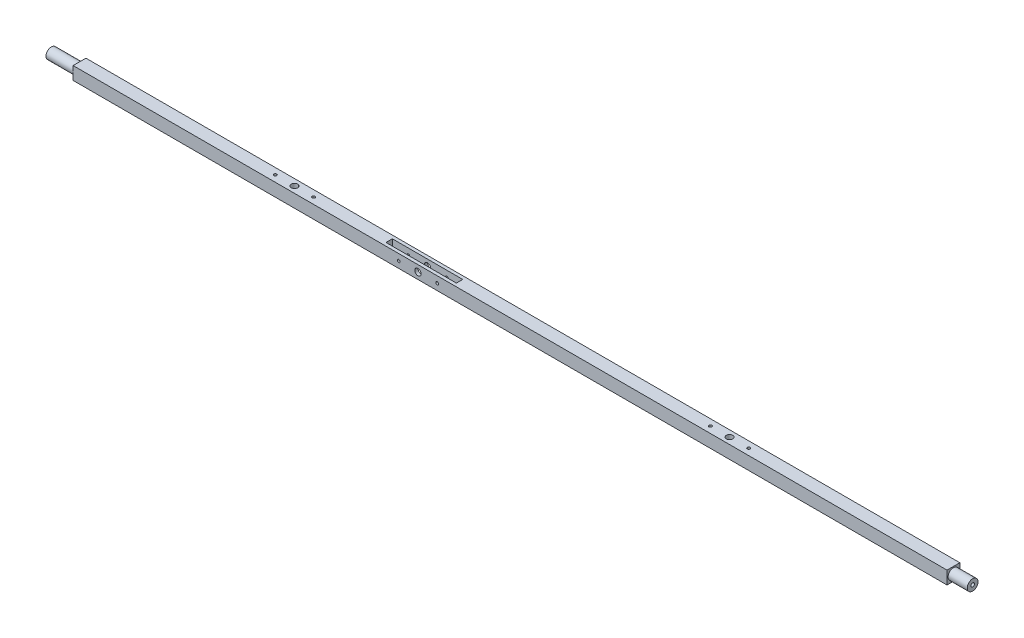
ISO-10303-21;
HEADER;
FILE_DESCRIPTION(('STEP AP214'),'2;1');
FILE_NAME('part.step','',(''),(''),'','','');
FILE_SCHEMA(('AUTOMOTIVE_DESIGN { 1 0 10303 214 1 1 1 1 }'));
ENDSEC;
DATA;
#1=APPLICATION_CONTEXT('core data for automotive mechanical design processes');
#2=APPLICATION_PROTOCOL_DEFINITION('international standard','automotive_design',2000,#1);
#3=PRODUCT_CONTEXT('',#1,'mechanical');
#4=PRODUCT('Part','Part','',(#3));
#5=PRODUCT_RELATED_PRODUCT_CATEGORY('part','',(#4));
#6=PRODUCT_DEFINITION_FORMATION('','',#4);
#7=PRODUCT_DEFINITION_CONTEXT('part definition',#1,'design');
#8=PRODUCT_DEFINITION('design','',#6,#7);
#9=PRODUCT_DEFINITION_SHAPE('','',#8);
#10=(LENGTH_UNIT() NAMED_UNIT(*) SI_UNIT(.MILLI.,.METRE.));
#11=(NAMED_UNIT(*) PLANE_ANGLE_UNIT() SI_UNIT($,.RADIAN.));
#12=(NAMED_UNIT(*) SI_UNIT($,.STERADIAN.) SOLID_ANGLE_UNIT());
#13=UNCERTAINTY_MEASURE_WITH_UNIT(LENGTH_MEASURE(1.E-05),#10,'distance_accuracy_value','');
#14=(GEOMETRIC_REPRESENTATION_CONTEXT(3) GLOBAL_UNCERTAINTY_ASSIGNED_CONTEXT((#13)) GLOBAL_UNIT_ASSIGNED_CONTEXT((#10,
#11,#12)) REPRESENTATION_CONTEXT('',''));
#15=CARTESIAN_POINT('',(0.,0.,0.));
#16=DIRECTION('',(0.,0.,1.));
#17=DIRECTION('',(1.,0.,0.));
#18=AXIS2_PLACEMENT_3D('',#15,#16,#17);
#19=CARTESIAN_POINT('',(457.2,-6.41066878980892,-6.35));
#20=DIRECTION('',(0.,0.,1.));
#21=DIRECTION('',(1.,0.,0.));
#22=AXIS2_PLACEMENT_3D('',#19,#20,#21);
#23=PLANE('',#22);
#24=CARTESIAN_POINT('',(-106.035602,0.,-6.35));
#25=DIRECTION('',(0.,0.,1.));
#26=DIRECTION('',(1.,0.,0.));
#27=AXIS2_PLACEMENT_3D('',#24,#25,#26);
#28=CIRCLE('',#27,1.39699999999999);
#29=CARTESIAN_POINT('',(-104.638602,0.,-6.35));
#30=VERTEX_POINT('',#29);
#31=EDGE_CURVE('E290',#30,#30,#28,.T.);
#32=ORIENTED_EDGE('',*,*,#31,.T.);
#33=EDGE_LOOP('',(#32));
#34=FACE_BOUND('',#33,.T.);
#35=CARTESIAN_POINT('',(-86.985602,0.,-6.35));
#36=DIRECTION('',(0.,0.,1.));
#37=DIRECTION('',(1.,0.,0.));
#38=AXIS2_PLACEMENT_3D('',#35,#36,#37);
#39=CIRCLE('',#38,3.175);
#40=CARTESIAN_POINT('',(-83.810602,0.,-6.35));
#41=VERTEX_POINT('',#40);
#42=EDGE_CURVE('E311',#41,#41,#39,.T.);
#43=ORIENTED_EDGE('',*,*,#42,.T.);
#44=EDGE_LOOP('',(#43));
#45=FACE_BOUND('',#44,.T.);
#46=CARTESIAN_POINT('',(-67.935602,0.,-6.35));
#47=DIRECTION('',(0.,0.,1.));
#48=DIRECTION('',(1.,0.,0.));
#49=AXIS2_PLACEMENT_3D('',#46,#47,#48);
#50=CIRCLE('',#49,1.39700000000001);
#51=CARTESIAN_POINT('',(-66.538602,0.,-6.35));
#52=VERTEX_POINT('',#51);
#53=EDGE_CURVE('E305',#52,#52,#50,.T.);
#54=ORIENTED_EDGE('',*,*,#53,.T.);
#55=EDGE_LOOP('',(#54));
#56=FACE_BOUND('',#55,.T.);
#57=DIRECTION('',(0.,1.,0.));
#58=VECTOR('',#57,1.);
#59=CARTESIAN_POINT('',(-429.26,0.,-6.35));
#60=LINE('',#59,#58);
#61=CARTESIAN_POINT('',(-429.26,-6.41066878980892,-6.35));
#62=VERTEX_POINT('',#61);
#63=CARTESIAN_POINT('',(-429.26,6.41066878980892,-6.35));
#64=VERTEX_POINT('',#63);
#65=EDGE_CURVE('E258',#62,#64,#60,.T.);
#66=ORIENTED_EDGE('',*,*,#65,.T.);
#67=DIRECTION('',(-1.,0.,0.));
#68=VECTOR('',#67,1.);
#69=CARTESIAN_POINT('',(457.2,6.41066878980892,-6.35));
#70=LINE('',#69,#68);
#71=CARTESIAN_POINT('',(438.15,6.41066878980892,-6.35));
#72=VERTEX_POINT('',#71);
#73=EDGE_CURVE('E12',#72,#64,#70,.T.);
#74=ORIENTED_EDGE('',*,*,#73,.F.);
#75=DIRECTION('',(0.,1.,0.));
#76=VECTOR('',#75,1.);
#77=CARTESIAN_POINT('',(438.15,0.,-6.35));
#78=LINE('',#77,#76);
#79=CARTESIAN_POINT('',(438.15,-6.41066878980892,-6.35));
#80=VERTEX_POINT('',#79);
#81=EDGE_CURVE('E269',#80,#72,#78,.T.);
#82=ORIENTED_EDGE('',*,*,#81,.F.);
#83=DIRECTION('',(-1.,0.,0.));
#84=VECTOR('',#83,1.);
#85=CARTESIAN_POINT('',(457.2,-6.41066878980892,-6.35));
#86=LINE('',#85,#84);
#87=EDGE_CURVE('E277',#80,#62,#86,.T.);
#88=ORIENTED_EDGE('',*,*,#87,.T.);
#89=EDGE_LOOP('',(#66,#74,#82,#88));
#90=FACE_BOUND('',#89,.T.);
#91=ADVANCED_FACE('F94',(#34,#45,#56,#90),#23,.F.);
#92=CARTESIAN_POINT('',(457.2,6.41066878980892,6.35));
#93=DIRECTION('',(0.,-1.,0.));
#94=DIRECTION('',(0.,0.,-1.));
#95=AXIS2_PLACEMENT_3D('',#92,#93,#94);
#96=PLANE('',#95);
#97=DIRECTION('',(1.,0.,0.));
#98=VECTOR('',#97,1.);
#99=CARTESIAN_POINT('',(-52.060602,6.41066878980892,-3.175));
#100=LINE('',#99,#98);
#101=CARTESIAN_POINT('',(-121.910602,6.41066878980892,-3.175));
#102=VERTEX_POINT('',#101);
#103=CARTESIAN_POINT('',(-52.060602,6.41066878980892,-3.175));
#104=VERTEX_POINT('',#103);
#105=EDGE_CURVE('E168',#102,#104,#100,.T.);
#106=ORIENTED_EDGE('',*,*,#105,.T.);
#107=DIRECTION('',(0.,0.,1.));
#108=VECTOR('',#107,1.);
#109=CARTESIAN_POINT('',(-52.060602,6.41066878980892,-3.175));
#110=LINE('',#109,#108);
#111=CARTESIAN_POINT('',(-52.060602,6.41066878980892,3.175));
#112=VERTEX_POINT('',#111);
#113=EDGE_CURVE('E162',#104,#112,#110,.T.);
#114=ORIENTED_EDGE('',*,*,#113,.T.);
#115=DIRECTION('',(-1.,0.,0.));
#116=VECTOR('',#115,1.);
#117=CARTESIAN_POINT('',(-52.060602,6.41066878980892,3.175));
#118=LINE('',#117,#116);
#119=CARTESIAN_POINT('',(-121.910602,6.41066878980892,3.175));
#120=VERTEX_POINT('',#119);
#121=EDGE_CURVE('E171',#112,#120,#118,.T.);
#122=ORIENTED_EDGE('',*,*,#121,.T.);
#123=DIRECTION('',(0.,0.,-1.));
#124=VECTOR('',#123,1.);
#125=CARTESIAN_POINT('',(-121.910602,6.41066878980892,-3.175));
#126=LINE('',#125,#124);
#127=EDGE_CURVE('E110',#120,#102,#126,.T.);
#128=ORIENTED_EDGE('',*,*,#127,.T.);
#129=EDGE_LOOP('',(#106,#114,#122,#128));
#130=FACE_BOUND('',#129,.T.);
#131=CARTESIAN_POINT('',(234.95,6.41066878980892,0.));
#132=DIRECTION('',(0.,1.,0.));
#133=DIRECTION('',(0.,0.,1.));
#134=AXIS2_PLACEMENT_3D('',#131,#132,#133);
#135=CIRCLE('',#134,1.42239999999999);
#136=CARTESIAN_POINT('',(234.95,6.41066878980892,1.42239999999999));
#137=VERTEX_POINT('',#136);
#138=EDGE_CURVE('E204',#137,#137,#135,.T.);
#139=ORIENTED_EDGE('',*,*,#138,.F.);
#140=EDGE_LOOP('',(#139));
#141=FACE_BOUND('',#140,.T.);
#142=CARTESIAN_POINT('',(196.85,6.41066878980892,0.));
#143=DIRECTION('',(0.,1.,0.));
#144=DIRECTION('',(0.,0.,1.));
#145=AXIS2_PLACEMENT_3D('',#142,#143,#144);
#146=CIRCLE('',#145,1.42239999999999);
#147=CARTESIAN_POINT('',(196.85,6.41066878980892,1.42239999999999));
#148=VERTEX_POINT('',#147);
#149=EDGE_CURVE('E196',#148,#148,#146,.T.);
#150=ORIENTED_EDGE('',*,*,#149,.F.);
#151=EDGE_LOOP('',(#150));
#152=FACE_BOUND('',#151,.T.);
#153=CARTESIAN_POINT('',(215.9,6.41066878980892,0.));
#154=DIRECTION('',(0.,1.,0.));
#155=DIRECTION('',(0.,0.,1.));
#156=AXIS2_PLACEMENT_3D('',#153,#154,#155);
#157=CIRCLE('',#156,3.17499999999997);
#158=CARTESIAN_POINT('',(215.9,6.41066878980892,3.17499999999997));
#159=VERTEX_POINT('',#158);
#160=EDGE_CURVE('E203',#159,#159,#157,.T.);
#161=ORIENTED_EDGE('',*,*,#160,.F.);
#162=EDGE_LOOP('',(#161));
#163=FACE_BOUND('',#162,.T.);
#164=CARTESIAN_POINT('',(-215.9,6.41066878980892,0.));
#165=DIRECTION('',(0.,1.,0.));
#166=DIRECTION('',(0.,0.,1.));
#167=AXIS2_PLACEMENT_3D('',#164,#165,#166);
#168=CIRCLE('',#167,3.17499999999997);
#169=CARTESIAN_POINT('',(-215.9,6.41066878980892,3.17499999999997));
#170=VERTEX_POINT('',#169);
#171=EDGE_CURVE('E217',#170,#170,#168,.T.);
#172=ORIENTED_EDGE('',*,*,#171,.F.);
#173=EDGE_LOOP('',(#172));
#174=FACE_BOUND('',#173,.T.);
#175=CARTESIAN_POINT('',(-196.85,6.41066878980892,0.));
#176=DIRECTION('',(0.,1.,0.));
#177=DIRECTION('',(0.,0.,1.));
#178=AXIS2_PLACEMENT_3D('',#175,#176,#177);
#179=CIRCLE('',#178,1.42239999999999);
#180=CARTESIAN_POINT('',(-196.85,6.41066878980892,1.4224));
#181=VERTEX_POINT('',#180);
#182=EDGE_CURVE('E228',#181,#181,#179,.T.);
#183=ORIENTED_EDGE('',*,*,#182,.F.);
#184=EDGE_LOOP('',(#183));
#185=FACE_BOUND('',#184,.T.);
#186=CARTESIAN_POINT('',(-234.95,6.41066878980892,0.));
#187=DIRECTION('',(0.,1.,0.));
#188=DIRECTION('',(0.,0.,1.));
#189=AXIS2_PLACEMENT_3D('',#186,#187,#188);
#190=CIRCLE('',#189,1.42239999999999);
#191=CARTESIAN_POINT('',(-234.95,6.41066878980892,1.42239999999999));
#192=VERTEX_POINT('',#191);
#193=EDGE_CURVE('E223',#192,#192,#190,.T.);
#194=ORIENTED_EDGE('',*,*,#193,.F.);
#195=EDGE_LOOP('',(#194));
#196=FACE_BOUND('',#195,.T.);
#197=DIRECTION('',(0.,0.,1.));
#198=VECTOR('',#197,1.);
#199=CARTESIAN_POINT('',(-429.26,6.41066878980892,0.));
#200=LINE('',#199,#198);
#201=CARTESIAN_POINT('',(-429.26,6.41066878980892,6.35));
#202=VERTEX_POINT('',#201);
#203=EDGE_CURVE('E255',#64,#202,#200,.T.);
#204=ORIENTED_EDGE('',*,*,#203,.T.);
#205=DIRECTION('',(-1.,0.,0.));
#206=VECTOR('',#205,1.);
#207=CARTESIAN_POINT('',(457.2,6.41066878980892,6.35));
#208=LINE('',#207,#206);
#209=CARTESIAN_POINT('',(438.15,6.41066878980892,6.35));
#210=VERTEX_POINT('',#209);
#211=EDGE_CURVE('E102',#210,#202,#208,.T.);
#212=ORIENTED_EDGE('',*,*,#211,.F.);
#213=DIRECTION('',(0.,0.,-1.));
#214=VECTOR('',#213,1.);
#215=CARTESIAN_POINT('',(438.15,6.41066878980892,0.));
#216=LINE('',#215,#214);
#217=EDGE_CURVE('E271',#210,#72,#216,.T.);
#218=ORIENTED_EDGE('',*,*,#217,.T.);
#219=ORIENTED_EDGE('',*,*,#73,.T.);
#220=EDGE_LOOP('',(#204,#212,#218,#219));
#221=FACE_BOUND('',#220,.T.);
#222=ADVANCED_FACE('F175',(#130,#141,#152,#163,#174,#185,#196,#221),#96,.F.);
#223=CARTESIAN_POINT('',(457.2,-6.41066878980892,6.35));
#224=DIRECTION('',(0.,0.,-1.));
#225=DIRECTION('',(-1.,0.,0.));
#226=AXIS2_PLACEMENT_3D('',#223,#224,#225);
#227=PLANE('',#226);
#228=CARTESIAN_POINT('',(-106.035602,0.,6.35));
#229=DIRECTION('',(0.,0.,1.));
#230=DIRECTION('',(1.,0.,0.));
#231=AXIS2_PLACEMENT_3D('',#228,#229,#230);
#232=CIRCLE('',#231,1.39699999999999);
#233=CARTESIAN_POINT('',(-104.638602,0.,6.35));
#234=VERTEX_POINT('',#233);
#235=EDGE_CURVE('E314',#234,#234,#232,.T.);
#236=ORIENTED_EDGE('',*,*,#235,.F.);
#237=EDGE_LOOP('',(#236));
#238=FACE_BOUND('',#237,.T.);
#239=CARTESIAN_POINT('',(-86.985602,0.,6.35));
#240=DIRECTION('',(0.,0.,1.));
#241=DIRECTION('',(1.,0.,0.));
#242=AXIS2_PLACEMENT_3D('',#239,#240,#241);
#243=CIRCLE('',#242,3.175);
#244=CARTESIAN_POINT('',(-83.810602,0.,6.35));
#245=VERTEX_POINT('',#244);
#246=EDGE_CURVE('E308',#245,#245,#243,.T.);
#247=ORIENTED_EDGE('',*,*,#246,.F.);
#248=EDGE_LOOP('',(#247));
#249=FACE_BOUND('',#248,.T.);
#250=CARTESIAN_POINT('',(-67.935602,0.,6.35));
#251=DIRECTION('',(0.,0.,1.));
#252=DIRECTION('',(1.,0.,0.));
#253=AXIS2_PLACEMENT_3D('',#250,#251,#252);
#254=CIRCLE('',#253,1.39700000000001);
#255=CARTESIAN_POINT('',(-66.538602,0.,6.35));
#256=VERTEX_POINT('',#255);
#257=EDGE_CURVE('E302',#256,#256,#254,.T.);
#258=ORIENTED_EDGE('',*,*,#257,.F.);
#259=EDGE_LOOP('',(#258));
#260=FACE_BOUND('',#259,.T.);
#261=DIRECTION('',(0.,1.,0.));
#262=VECTOR('',#261,1.);
#263=CARTESIAN_POINT('',(-429.26,0.,6.35));
#264=LINE('',#263,#262);
#265=CARTESIAN_POINT('',(-429.26,-6.41066878980892,6.35));
#266=VERTEX_POINT('',#265);
#267=EDGE_CURVE('E253',#266,#202,#264,.T.);
#268=ORIENTED_EDGE('',*,*,#267,.F.);
#269=DIRECTION('',(-1.,0.,0.));
#270=VECTOR('',#269,1.);
#271=CARTESIAN_POINT('',(457.2,-6.41066878980892,6.35));
#272=LINE('',#271,#270);
#273=CARTESIAN_POINT('',(438.15,-6.41066878980892,6.35));
#274=VERTEX_POINT('',#273);
#275=EDGE_CURVE('E282',#274,#266,#272,.T.);
#276=ORIENTED_EDGE('',*,*,#275,.F.);
#277=DIRECTION('',(0.,1.,0.));
#278=VECTOR('',#277,1.);
#279=CARTESIAN_POINT('',(438.15,0.,6.35));
#280=LINE('',#279,#278);
#281=EDGE_CURVE('E274',#274,#210,#280,.T.);
#282=ORIENTED_EDGE('',*,*,#281,.T.);
#283=ORIENTED_EDGE('',*,*,#211,.T.);
#284=EDGE_LOOP('',(#268,#276,#282,#283));
#285=FACE_BOUND('',#284,.T.);
#286=ADVANCED_FACE('F352',(#238,#249,#260,#285),#227,.F.);
#287=CARTESIAN_POINT('',(457.2,-6.41066878980892,6.35));
#288=DIRECTION('',(0.,1.,0.));
#289=DIRECTION('',(0.,0.,1.));
#290=AXIS2_PLACEMENT_3D('',#287,#288,#289);
#291=PLANE('',#290);
#292=DIRECTION('',(-1.,0.,0.));
#293=VECTOR('',#292,1.);
#294=CARTESIAN_POINT('',(-52.060602,-6.41066878980892,3.175));
#295=LINE('',#294,#293);
#296=CARTESIAN_POINT('',(-52.060602,-6.41066878980892,3.175));
#297=VERTEX_POINT('',#296);
#298=CARTESIAN_POINT('',(-121.910602,-6.41066878980892,3.175));
#299=VERTEX_POINT('',#298);
#300=EDGE_CURVE('E190',#297,#299,#295,.T.);
#301=ORIENTED_EDGE('',*,*,#300,.F.);
#302=DIRECTION('',(0.,0.,1.));
#303=VECTOR('',#302,1.);
#304=CARTESIAN_POINT('',(-52.060602,-6.41066878980892,-3.175));
#305=LINE('',#304,#303);
#306=CARTESIAN_POINT('',(-52.060602,-6.41066878980892,-3.175));
#307=VERTEX_POINT('',#306);
#308=EDGE_CURVE('E118',#307,#297,#305,.T.);
#309=ORIENTED_EDGE('',*,*,#308,.F.);
#310=DIRECTION('',(1.,0.,0.));
#311=VECTOR('',#310,1.);
#312=CARTESIAN_POINT('',(-52.060602,-6.41066878980892,-3.175));
#313=LINE('',#312,#311);
#314=CARTESIAN_POINT('',(-121.910602,-6.41066878980892,-3.175));
#315=VERTEX_POINT('',#314);
#316=EDGE_CURVE('E178',#315,#307,#313,.T.);
#317=ORIENTED_EDGE('',*,*,#316,.F.);
#318=DIRECTION('',(0.,0.,-1.));
#319=VECTOR('',#318,1.);
#320=CARTESIAN_POINT('',(-121.910602,-6.41066878980892,-3.175));
#321=LINE('',#320,#319);
#322=EDGE_CURVE('E181',#299,#315,#321,.T.);
#323=ORIENTED_EDGE('',*,*,#322,.F.);
#324=EDGE_LOOP('',(#301,#309,#317,#323));
#325=FACE_BOUND('',#324,.T.);
#326=CARTESIAN_POINT('',(215.9,-6.41066878980892,0.));
#327=DIRECTION('',(0.,1.,0.));
#328=DIRECTION('',(0.,0.,1.));
#329=AXIS2_PLACEMENT_3D('',#326,#327,#328);
#330=CIRCLE('',#329,3.17499999999997);
#331=CARTESIAN_POINT('',(215.9,-6.41066878980892,3.17499999999997));
#332=VERTEX_POINT('',#331);
#333=EDGE_CURVE('E214',#332,#332,#330,.F.);
#334=ORIENTED_EDGE('',*,*,#333,.F.);
#335=EDGE_LOOP('',(#334));
#336=FACE_BOUND('',#335,.T.);
#337=CARTESIAN_POINT('',(-215.9,-6.41066878980892,0.));
#338=DIRECTION('',(0.,1.,0.));
#339=DIRECTION('',(0.,0.,1.));
#340=AXIS2_PLACEMENT_3D('',#337,#338,#339);
#341=CIRCLE('',#340,3.17499999999997);
#342=CARTESIAN_POINT('',(-215.9,-6.41066878980892,3.17499999999997));
#343=VERTEX_POINT('',#342);
#344=EDGE_CURVE('E220',#343,#343,#341,.F.);
#345=ORIENTED_EDGE('',*,*,#344,.F.);
#346=EDGE_LOOP('',(#345));
#347=FACE_BOUND('',#346,.T.);
#348=DIRECTION('',(0.,0.,1.));
#349=VECTOR('',#348,1.);
#350=CARTESIAN_POINT('',(-429.26,-6.41066878980892,0.));
#351=LINE('',#350,#349);
#352=EDGE_CURVE('E251',#62,#266,#351,.T.);
#353=ORIENTED_EDGE('',*,*,#352,.F.);
#354=ORIENTED_EDGE('',*,*,#87,.F.);
#355=DIRECTION('',(0.,0.,-1.));
#356=VECTOR('',#355,1.);
#357=CARTESIAN_POINT('',(438.15,-6.41066878980892,0.));
#358=LINE('',#357,#356);
#359=EDGE_CURVE('E267',#274,#80,#358,.T.);
#360=ORIENTED_EDGE('',*,*,#359,.F.);
#361=ORIENTED_EDGE('',*,*,#275,.T.);
#362=EDGE_LOOP('',(#353,#354,#360,#361));
#363=FACE_BOUND('',#362,.T.);
#364=ADVANCED_FACE('F356',(#325,#336,#347,#363),#291,.F.);
#365=CARTESIAN_POINT('',(438.15,0.,0.));
#366=DIRECTION('',(1.,0.,0.));
#367=DIRECTION('',(0.,0.,-1.));
#368=AXIS2_PLACEMENT_3D('',#365,#366,#367);
#369=CYLINDRICAL_SURFACE('',#368,5.334);
#370=CARTESIAN_POINT('',(438.15,0.,0.));
#371=DIRECTION('',(1.,0.,0.));
#372=DIRECTION('',(0.,0.,-1.));
#373=AXIS2_PLACEMENT_3D('',#370,#371,#372);
#374=CIRCLE('',#373,5.334);
#375=CARTESIAN_POINT('',(438.15,0.,-5.334));
#376=VERTEX_POINT('',#375);
#377=EDGE_CURVE('E264',#376,#376,#374,.T.);
#378=ORIENTED_EDGE('',*,*,#377,.T.);
#379=EDGE_LOOP('',(#378));
#380=FACE_BOUND('',#379,.T.);
#381=CARTESIAN_POINT('',(457.2,0.,0.));
#382=DIRECTION('',(1.,0.,0.));
#383=DIRECTION('',(0.,0.,-1.));
#384=AXIS2_PLACEMENT_3D('',#381,#382,#383);
#385=CIRCLE('',#384,5.334);
#386=CARTESIAN_POINT('',(457.2,0.,-5.334));
#387=VERTEX_POINT('',#386);
#388=EDGE_CURVE('E261',#387,#387,#385,.T.);
#389=ORIENTED_EDGE('',*,*,#388,.F.);
#390=EDGE_LOOP('',(#389));
#391=FACE_BOUND('',#390,.T.);
#392=ADVANCED_FACE('F362',(#380,#391),#369,.T.);
#393=CARTESIAN_POINT('',(438.15,0.,0.));
#394=DIRECTION('',(1.,0.,0.));
#395=DIRECTION('',(0.,0.,-1.));
#396=AXIS2_PLACEMENT_3D('',#393,#394,#395);
#397=PLANE('',#396);
#398=ORIENTED_EDGE('',*,*,#377,.F.);
#399=EDGE_LOOP('',(#398));
#400=FACE_BOUND('',#399,.T.);
#401=ORIENTED_EDGE('',*,*,#359,.T.);
#402=ORIENTED_EDGE('',*,*,#81,.T.);
#403=ORIENTED_EDGE('',*,*,#217,.F.);
#404=ORIENTED_EDGE('',*,*,#281,.F.);
#405=EDGE_LOOP('',(#401,#402,#403,#404));
#406=FACE_BOUND('',#405,.T.);
#407=ADVANCED_FACE('F374',(#400,#406),#397,.T.);
#408=CARTESIAN_POINT('',(457.2,0.,0.));
#409=DIRECTION('',(-1.,0.,0.));
#410=DIRECTION('',(0.,0.,1.));
#411=AXIS2_PLACEMENT_3D('',#408,#409,#410);
#412=PLANE('',#411);
#413=CARTESIAN_POINT('',(457.2,0.,0.));
#414=DIRECTION('',(1.,0.,0.));
#415=DIRECTION('',(0.,0.,-1.));
#416=AXIS2_PLACEMENT_3D('',#413,#414,#415);
#417=CIRCLE('',#416,1.7526);
#418=CARTESIAN_POINT('',(457.2,0.,-1.7526));
#419=VERTEX_POINT('',#418);
#420=EDGE_CURVE('E239',#419,#419,#417,.T.);
#421=ORIENTED_EDGE('',*,*,#420,.F.);
#422=EDGE_LOOP('',(#421));
#423=FACE_BOUND('',#422,.T.);
#424=ORIENTED_EDGE('',*,*,#388,.T.);
#425=EDGE_LOOP('',(#424));
#426=FACE_BOUND('',#425,.T.);
#427=ADVANCED_FACE('F370',(#423,#426),#412,.F.);
#428=CARTESIAN_POINT('',(-429.26,0.,0.));
#429=DIRECTION('',(-1.,0.,0.));
#430=DIRECTION('',(0.,0.,1.));
#431=AXIS2_PLACEMENT_3D('',#428,#429,#430);
#432=CYLINDRICAL_SURFACE('',#431,5.334);
#433=CARTESIAN_POINT('',(-429.26,0.,0.));
#434=DIRECTION('',(-1.,0.,0.));
#435=DIRECTION('',(0.,0.,1.));
#436=AXIS2_PLACEMENT_3D('',#433,#434,#435);
#437=CIRCLE('',#436,5.334);
#438=CARTESIAN_POINT('',(-429.26,0.,5.334));
#439=VERTEX_POINT('',#438);
#440=EDGE_CURVE('E248',#439,#439,#437,.T.);
#441=ORIENTED_EDGE('',*,*,#440,.T.);
#442=EDGE_LOOP('',(#441));
#443=FACE_BOUND('',#442,.T.);
#444=CARTESIAN_POINT('',(-457.2,0.,0.));
#445=DIRECTION('',(-1.,0.,0.));
#446=DIRECTION('',(0.,0.,1.));
#447=AXIS2_PLACEMENT_3D('',#444,#445,#446);
#448=CIRCLE('',#447,5.334);
#449=CARTESIAN_POINT('',(-457.2,0.,5.334));
#450=VERTEX_POINT('',#449);
#451=EDGE_CURVE('E245',#450,#450,#448,.T.);
#452=ORIENTED_EDGE('',*,*,#451,.F.);
#453=EDGE_LOOP('',(#452));
#454=FACE_BOUND('',#453,.T.);
#455=ADVANCED_FACE('F373',(#443,#454),#432,.T.);
#456=CARTESIAN_POINT('',(-429.26,0.,0.));
#457=DIRECTION('',(-1.,0.,0.));
#458=DIRECTION('',(0.,0.,1.));
#459=AXIS2_PLACEMENT_3D('',#456,#457,#458);
#460=PLANE('',#459);
#461=ORIENTED_EDGE('',*,*,#440,.F.);
#462=EDGE_LOOP('',(#461));
#463=FACE_BOUND('',#462,.T.);
#464=ORIENTED_EDGE('',*,*,#352,.T.);
#465=ORIENTED_EDGE('',*,*,#267,.T.);
#466=ORIENTED_EDGE('',*,*,#203,.F.);
#467=ORIENTED_EDGE('',*,*,#65,.F.);
#468=EDGE_LOOP('',(#464,#465,#466,#467));
#469=FACE_BOUND('',#468,.T.);
#470=ADVANCED_FACE('F368',(#463,#469),#460,.T.);
#471=CARTESIAN_POINT('',(-457.2,0.,0.));
#472=DIRECTION('',(-1.,0.,0.));
#473=DIRECTION('',(0.,0.,1.));
#474=AXIS2_PLACEMENT_3D('',#471,#472,#473);
#475=PLANE('',#474);
#476=CARTESIAN_POINT('',(-457.2,0.,0.));
#477=DIRECTION('',(-1.,0.,0.));
#478=DIRECTION('',(0.,0.,1.));
#479=AXIS2_PLACEMENT_3D('',#476,#477,#478);
#480=CIRCLE('',#479,1.7526);
#481=CARTESIAN_POINT('',(-457.2,0.,1.7526));
#482=VERTEX_POINT('',#481);
#483=EDGE_CURVE('E227',#482,#482,#480,.T.);
#484=ORIENTED_EDGE('',*,*,#483,.F.);
#485=EDGE_LOOP('',(#484));
#486=FACE_BOUND('',#485,.T.);
#487=ORIENTED_EDGE('',*,*,#451,.T.);
#488=EDGE_LOOP('',(#487));
#489=FACE_BOUND('',#488,.T.);
#490=ADVANCED_FACE('F364',(#486,#489),#475,.T.);
#491=CARTESIAN_POINT('',(444.5,0.,0.));
#492=DIRECTION('',(1.,0.,0.));
#493=DIRECTION('',(0.,0.,-1.));
#494=AXIS2_PLACEMENT_3D('',#491,#492,#493);
#495=CYLINDRICAL_SURFACE('',#494,1.7526);
#496=CARTESIAN_POINT('',(444.5,0.,0.));
#497=DIRECTION('',(1.,0.,0.));
#498=DIRECTION('',(0.,0.,-1.));
#499=AXIS2_PLACEMENT_3D('',#496,#497,#498);
#500=CIRCLE('',#499,1.7526);
#501=CARTESIAN_POINT('',(444.5,0.,-1.7526));
#502=VERTEX_POINT('',#501);
#503=EDGE_CURVE('E242',#502,#502,#500,.T.);
#504=ORIENTED_EDGE('',*,*,#503,.F.);
#505=EDGE_LOOP('',(#504));
#506=FACE_BOUND('',#505,.T.);
#507=ORIENTED_EDGE('',*,*,#420,.T.);
#508=EDGE_LOOP('',(#507));
#509=FACE_BOUND('',#508,.T.);
#510=ADVANCED_FACE('F367',(#506,#509),#495,.F.);
#511=CARTESIAN_POINT('',(444.5,0.,0.));
#512=DIRECTION('',(1.,0.,0.));
#513=DIRECTION('',(0.,0.,-1.));
#514=AXIS2_PLACEMENT_3D('',#511,#512,#513);
#515=PLANE('',#514);
#516=ORIENTED_EDGE('',*,*,#503,.T.);
#517=EDGE_LOOP('',(#516));
#518=FACE_BOUND('',#517,.T.);
#519=ADVANCED_FACE('F390',(#518),#515,.T.);
#520=CARTESIAN_POINT('',(-438.15,0.,0.));
#521=DIRECTION('',(-1.,0.,0.));
#522=DIRECTION('',(0.,0.,1.));
#523=AXIS2_PLACEMENT_3D('',#520,#521,#522);
#524=CYLINDRICAL_SURFACE('',#523,1.7526);
#525=CARTESIAN_POINT('',(-438.15,0.,0.));
#526=DIRECTION('',(-1.,0.,0.));
#527=DIRECTION('',(0.,0.,1.));
#528=AXIS2_PLACEMENT_3D('',#525,#526,#527);
#529=CIRCLE('',#528,1.7526);
#530=CARTESIAN_POINT('',(-438.15,0.,1.7526));
#531=VERTEX_POINT('',#530);
#532=EDGE_CURVE('E236',#531,#531,#529,.T.);
#533=ORIENTED_EDGE('',*,*,#532,.F.);
#534=EDGE_LOOP('',(#533));
#535=FACE_BOUND('',#534,.T.);
#536=ORIENTED_EDGE('',*,*,#483,.T.);
#537=EDGE_LOOP('',(#536));
#538=FACE_BOUND('',#537,.T.);
#539=ADVANCED_FACE('F394',(#535,#538),#524,.F.);
#540=CARTESIAN_POINT('',(-438.15,0.,0.));
#541=DIRECTION('',(-1.,0.,0.));
#542=DIRECTION('',(0.,0.,1.));
#543=AXIS2_PLACEMENT_3D('',#540,#541,#542);
#544=PLANE('',#543);
#545=ORIENTED_EDGE('',*,*,#532,.T.);
#546=EDGE_LOOP('',(#545));
#547=FACE_BOUND('',#546,.T.);
#548=ADVANCED_FACE('F398',(#547),#544,.T.);
#549=CARTESIAN_POINT('',(-234.95,-4.51133121019108,0.));
#550=DIRECTION('',(0.,1.,0.));
#551=DIRECTION('',(0.,0.,1.));
#552=AXIS2_PLACEMENT_3D('',#549,#550,#551);
#553=CYLINDRICAL_SURFACE('',#552,1.42239999999999);
#554=CARTESIAN_POINT('',(-234.95,-4.51133121019108,0.));
#555=DIRECTION('',(0.,1.,0.));
#556=DIRECTION('',(0.,0.,1.));
#557=AXIS2_PLACEMENT_3D('',#554,#555,#556);
#558=CIRCLE('',#557,1.42239999999999);
#559=CARTESIAN_POINT('',(-234.95,-4.51133121019108,1.42239999999999));
#560=VERTEX_POINT('',#559);
#561=EDGE_CURVE('E231',#560,#560,#558,.T.);
#562=ORIENTED_EDGE('',*,*,#561,.F.);
#563=EDGE_LOOP('',(#562));
#564=FACE_BOUND('',#563,.T.);
#565=ORIENTED_EDGE('',*,*,#193,.T.);
#566=EDGE_LOOP('',(#565));
#567=FACE_BOUND('',#566,.T.);
#568=ADVANCED_FACE('F402',(#564,#567),#553,.F.);
#569=CARTESIAN_POINT('',(0.,-4.51133121019108,0.));
#570=DIRECTION('',(0.,1.,0.));
#571=DIRECTION('',(0.,0.,1.));
#572=AXIS2_PLACEMENT_3D('',#569,#570,#571);
#573=PLANE('',#572);
#574=ORIENTED_EDGE('',*,*,#561,.T.);
#575=EDGE_LOOP('',(#574));
#576=FACE_BOUND('',#575,.T.);
#577=ADVANCED_FACE('F406',(#576),#573,.T.);
#578=CARTESIAN_POINT('',(-196.85,-4.51133121019108,0.));
#579=DIRECTION('',(0.,1.,0.));
#580=DIRECTION('',(0.,0.,1.));
#581=AXIS2_PLACEMENT_3D('',#578,#579,#580);
#582=CYLINDRICAL_SURFACE('',#581,1.42239999999999);
#583=CARTESIAN_POINT('',(-196.85,-4.51133121019108,0.));
#584=DIRECTION('',(0.,1.,0.));
#585=DIRECTION('',(0.,0.,1.));
#586=AXIS2_PLACEMENT_3D('',#583,#584,#585);
#587=CIRCLE('',#586,1.42239999999999);
#588=CARTESIAN_POINT('',(-196.85,-4.51133121019108,1.4224));
#589=VERTEX_POINT('',#588);
#590=EDGE_CURVE('E224',#589,#589,#587,.T.);
#591=ORIENTED_EDGE('',*,*,#590,.F.);
#592=EDGE_LOOP('',(#591));
#593=FACE_BOUND('',#592,.T.);
#594=ORIENTED_EDGE('',*,*,#182,.T.);
#595=EDGE_LOOP('',(#594));
#596=FACE_BOUND('',#595,.T.);
#597=ADVANCED_FACE('F410',(#593,#596),#582,.F.);
#598=CARTESIAN_POINT('',(0.,-4.51133121019108,0.));
#599=DIRECTION('',(0.,1.,0.));
#600=DIRECTION('',(0.,0.,1.));
#601=AXIS2_PLACEMENT_3D('',#598,#599,#600);
#602=PLANE('',#601);
#603=ORIENTED_EDGE('',*,*,#590,.T.);
#604=EDGE_LOOP('',(#603));
#605=FACE_BOUND('',#604,.T.);
#606=ADVANCED_FACE('F414',(#605),#602,.T.);
#607=CARTESIAN_POINT('',(-215.9,-6.41166878980892,0.));
#608=DIRECTION('',(0.,1.,0.));
#609=DIRECTION('',(0.,0.,1.));
#610=AXIS2_PLACEMENT_3D('',#607,#608,#609);
#611=CYLINDRICAL_SURFACE('',#610,3.17499999999997);
#612=ORIENTED_EDGE('',*,*,#171,.T.);
#613=EDGE_LOOP('',(#612));
#614=FACE_BOUND('',#613,.T.);
#615=ORIENTED_EDGE('',*,*,#344,.T.);
#616=EDGE_LOOP('',(#615));
#617=FACE_BOUND('',#616,.T.);
#618=ADVANCED_FACE('F418',(#614,#617),#611,.F.);
#619=CARTESIAN_POINT('',(215.9,-6.41166878980892,0.));
#620=DIRECTION('',(0.,1.,0.));
#621=DIRECTION('',(0.,0.,1.));
#622=AXIS2_PLACEMENT_3D('',#619,#620,#621);
#623=CYLINDRICAL_SURFACE('',#622,3.17499999999997);
#624=ORIENTED_EDGE('',*,*,#160,.T.);
#625=EDGE_LOOP('',(#624));
#626=FACE_BOUND('',#625,.T.);
#627=ORIENTED_EDGE('',*,*,#333,.T.);
#628=EDGE_LOOP('',(#627));
#629=FACE_BOUND('',#628,.T.);
#630=ADVANCED_FACE('F422',(#626,#629),#623,.F.);
#631=CARTESIAN_POINT('',(196.85,-4.51133121019108,0.));
#632=DIRECTION('',(0.,1.,0.));
#633=DIRECTION('',(0.,0.,1.));
#634=AXIS2_PLACEMENT_3D('',#631,#632,#633);
#635=CYLINDRICAL_SURFACE('',#634,1.42239999999999);
#636=CARTESIAN_POINT('',(196.85,-4.51133121019108,0.));
#637=DIRECTION('',(0.,1.,0.));
#638=DIRECTION('',(0.,0.,1.));
#639=AXIS2_PLACEMENT_3D('',#636,#637,#638);
#640=CIRCLE('',#639,1.42239999999999);
#641=CARTESIAN_POINT('',(196.85,-4.51133121019108,1.42239999999999));
#642=VERTEX_POINT('',#641);
#643=EDGE_CURVE('E207',#642,#642,#640,.T.);
#644=ORIENTED_EDGE('',*,*,#643,.F.);
#645=EDGE_LOOP('',(#644));
#646=FACE_BOUND('',#645,.T.);
#647=ORIENTED_EDGE('',*,*,#149,.T.);
#648=EDGE_LOOP('',(#647));
#649=FACE_BOUND('',#648,.T.);
#650=ADVANCED_FACE('F426',(#646,#649),#635,.F.);
#651=CARTESIAN_POINT('',(196.85,-4.51133121019108,0.));
#652=DIRECTION('',(0.,1.,0.));
#653=DIRECTION('',(0.,0.,1.));
#654=AXIS2_PLACEMENT_3D('',#651,#652,#653);
#655=PLANE('',#654);
#656=ORIENTED_EDGE('',*,*,#643,.T.);
#657=EDGE_LOOP('',(#656));
#658=FACE_BOUND('',#657,.T.);
#659=ADVANCED_FACE('F430',(#658),#655,.T.);
#660=CARTESIAN_POINT('',(234.95,-4.51133121019108,0.));
#661=DIRECTION('',(0.,1.,0.));
#662=DIRECTION('',(0.,0.,1.));
#663=AXIS2_PLACEMENT_3D('',#660,#661,#662);
#664=CYLINDRICAL_SURFACE('',#663,1.42239999999999);
#665=CARTESIAN_POINT('',(234.95,-4.51133121019108,0.));
#666=DIRECTION('',(0.,1.,0.));
#667=DIRECTION('',(0.,0.,1.));
#668=AXIS2_PLACEMENT_3D('',#665,#666,#667);
#669=CIRCLE('',#668,1.42239999999999);
#670=CARTESIAN_POINT('',(234.95,-4.51133121019108,1.42239999999999));
#671=VERTEX_POINT('',#670);
#672=EDGE_CURVE('E200',#671,#671,#669,.T.);
#673=ORIENTED_EDGE('',*,*,#672,.F.);
#674=EDGE_LOOP('',(#673));
#675=FACE_BOUND('',#674,.T.);
#676=ORIENTED_EDGE('',*,*,#138,.T.);
#677=EDGE_LOOP('',(#676));
#678=FACE_BOUND('',#677,.T.);
#679=ADVANCED_FACE('F434',(#675,#678),#664,.F.);
#680=CARTESIAN_POINT('',(234.95,-4.51133121019108,0.));
#681=DIRECTION('',(0.,1.,0.));
#682=DIRECTION('',(0.,0.,1.));
#683=AXIS2_PLACEMENT_3D('',#680,#681,#682);
#684=PLANE('',#683);
#685=ORIENTED_EDGE('',*,*,#672,.T.);
#686=EDGE_LOOP('',(#685));
#687=FACE_BOUND('',#686,.T.);
#688=ADVANCED_FACE('F438',(#687),#684,.T.);
#689=CARTESIAN_POINT('',(-52.060602,6.41066878980892,-3.175));
#690=DIRECTION('',(1.,0.,0.));
#691=DIRECTION('',(0.,0.,-1.));
#692=AXIS2_PLACEMENT_3D('',#689,#690,#691);
#693=PLANE('',#692);
#694=ORIENTED_EDGE('',*,*,#308,.T.);
#695=DIRECTION('',(0.,-1.,0.));
#696=VECTOR('',#695,1.);
#697=CARTESIAN_POINT('',(-52.060602,6.41066878980892,3.175));
#698=LINE('',#697,#696);
#699=EDGE_CURVE('E158',#112,#297,#698,.T.);
#700=ORIENTED_EDGE('',*,*,#699,.F.);
#701=ORIENTED_EDGE('',*,*,#113,.F.);
#702=DIRECTION('',(0.,-1.,0.));
#703=VECTOR('',#702,1.);
#704=CARTESIAN_POINT('',(-52.060602,6.41066878980892,-3.175));
#705=LINE('',#704,#703);
#706=EDGE_CURVE('E194',#104,#307,#705,.T.);
#707=ORIENTED_EDGE('',*,*,#706,.T.);
#708=EDGE_LOOP('',(#694,#700,#701,#707));
#709=FACE_BOUND('',#708,.T.);
#710=ADVANCED_FACE('F160',(#709),#693,.F.);
#711=CARTESIAN_POINT('',(-52.060602,6.41066878980892,-3.175));
#712=DIRECTION('',(0.,0.,-1.));
#713=DIRECTION('',(-1.,0.,0.));
#714=AXIS2_PLACEMENT_3D('',#711,#712,#713);
#715=PLANE('',#714);
#716=CARTESIAN_POINT('',(-106.035602,0.,-3.175));
#717=DIRECTION('',(0.,0.,-1.));
#718=DIRECTION('',(-1.,0.,0.));
#719=AXIS2_PLACEMENT_3D('',#716,#717,#718);
#720=CIRCLE('',#719,1.39699999999999);
#721=CARTESIAN_POINT('',(-107.432602,0.,-3.175));
#722=VERTEX_POINT('',#721);
#723=EDGE_CURVE('E184',#722,#722,#720,.T.);
#724=ORIENTED_EDGE('',*,*,#723,.T.);
#725=EDGE_LOOP('',(#724));
#726=FACE_BOUND('',#725,.T.);
#727=CARTESIAN_POINT('',(-86.985602,0.,-3.175));
#728=DIRECTION('',(0.,0.,-1.));
#729=DIRECTION('',(-1.,0.,0.));
#730=AXIS2_PLACEMENT_3D('',#727,#728,#729);
#731=CIRCLE('',#730,3.175);
#732=CARTESIAN_POINT('',(-90.160602,0.,-3.175));
#733=VERTEX_POINT('',#732);
#734=EDGE_CURVE('E293',#733,#733,#731,.T.);
#735=ORIENTED_EDGE('',*,*,#734,.T.);
#736=EDGE_LOOP('',(#735));
#737=FACE_BOUND('',#736,.T.);
#738=CARTESIAN_POINT('',(-67.935602,0.,-3.175));
#739=DIRECTION('',(0.,0.,-1.));
#740=DIRECTION('',(-1.,0.,0.));
#741=AXIS2_PLACEMENT_3D('',#738,#739,#740);
#742=CIRCLE('',#741,1.39700000000001);
#743=CARTESIAN_POINT('',(-69.3326020000001,0.,-3.175));
#744=VERTEX_POINT('',#743);
#745=EDGE_CURVE('E289',#744,#744,#742,.T.);
#746=ORIENTED_EDGE('',*,*,#745,.T.);
#747=EDGE_LOOP('',(#746));
#748=FACE_BOUND('',#747,.T.);
#749=ORIENTED_EDGE('',*,*,#316,.T.);
#750=ORIENTED_EDGE('',*,*,#706,.F.);
#751=ORIENTED_EDGE('',*,*,#105,.F.);
#752=DIRECTION('',(0.,-1.,0.));
#753=VECTOR('',#752,1.);
#754=CARTESIAN_POINT('',(-121.910602,6.41066878980892,-3.175));
#755=LINE('',#754,#753);
#756=EDGE_CURVE('E197',#102,#315,#755,.T.);
#757=ORIENTED_EDGE('',*,*,#756,.T.);
#758=EDGE_LOOP('',(#749,#750,#751,#757));
#759=FACE_BOUND('',#758,.T.);
#760=ADVANCED_FACE('F445',(#726,#737,#748,#759),#715,.F.);
#761=CARTESIAN_POINT('',(-121.910602,6.41066878980892,-3.175));
#762=DIRECTION('',(-1.,0.,0.));
#763=DIRECTION('',(0.,0.,1.));
#764=AXIS2_PLACEMENT_3D('',#761,#762,#763);
#765=PLANE('',#764);
#766=ORIENTED_EDGE('',*,*,#322,.T.);
#767=ORIENTED_EDGE('',*,*,#756,.F.);
#768=ORIENTED_EDGE('',*,*,#127,.F.);
#769=DIRECTION('',(0.,-1.,0.));
#770=VECTOR('',#769,1.);
#771=CARTESIAN_POINT('',(-121.910602,6.41066878980892,3.175));
#772=LINE('',#771,#770);
#773=EDGE_CURVE('E167',#120,#299,#772,.T.);
#774=ORIENTED_EDGE('',*,*,#773,.T.);
#775=EDGE_LOOP('',(#766,#767,#768,#774));
#776=FACE_BOUND('',#775,.T.);
#777=ADVANCED_FACE('F448',(#776),#765,.F.);
#778=CARTESIAN_POINT('',(-52.060602,6.41066878980892,3.175));
#779=DIRECTION('',(0.,0.,1.));
#780=DIRECTION('',(1.,0.,0.));
#781=AXIS2_PLACEMENT_3D('',#778,#779,#780);
#782=PLANE('',#781);
#783=CARTESIAN_POINT('',(-106.035602,0.,3.175));
#784=DIRECTION('',(0.,0.,1.));
#785=DIRECTION('',(1.,0.,0.));
#786=AXIS2_PLACEMENT_3D('',#783,#784,#785);
#787=CIRCLE('',#786,1.39699999999999);
#788=CARTESIAN_POINT('',(-104.638602,0.,3.175));
#789=VERTEX_POINT('',#788);
#790=EDGE_CURVE('E97',#789,#789,#787,.T.);
#791=ORIENTED_EDGE('',*,*,#790,.T.);
#792=EDGE_LOOP('',(#791));
#793=FACE_BOUND('',#792,.T.);
#794=CARTESIAN_POINT('',(-86.985602,0.,3.175));
#795=DIRECTION('',(0.,0.,1.));
#796=DIRECTION('',(1.,0.,0.));
#797=AXIS2_PLACEMENT_3D('',#794,#795,#796);
#798=CIRCLE('',#797,3.175);
#799=CARTESIAN_POINT('',(-83.810602,0.,3.175));
#800=VERTEX_POINT('',#799);
#801=EDGE_CURVE('E291',#800,#800,#798,.T.);
#802=ORIENTED_EDGE('',*,*,#801,.T.);
#803=EDGE_LOOP('',(#802));
#804=FACE_BOUND('',#803,.T.);
#805=CARTESIAN_POINT('',(-67.935602,0.,3.175));
#806=DIRECTION('',(0.,0.,1.));
#807=DIRECTION('',(1.,0.,0.));
#808=AXIS2_PLACEMENT_3D('',#805,#806,#807);
#809=CIRCLE('',#808,1.39700000000001);
#810=CARTESIAN_POINT('',(-66.538602,0.,3.175));
#811=VERTEX_POINT('',#810);
#812=EDGE_CURVE('E287',#811,#811,#809,.T.);
#813=ORIENTED_EDGE('',*,*,#812,.T.);
#814=EDGE_LOOP('',(#813));
#815=FACE_BOUND('',#814,.T.);
#816=ORIENTED_EDGE('',*,*,#300,.T.);
#817=ORIENTED_EDGE('',*,*,#773,.F.);
#818=ORIENTED_EDGE('',*,*,#121,.F.);
#819=ORIENTED_EDGE('',*,*,#699,.T.);
#820=EDGE_LOOP('',(#816,#817,#818,#819));
#821=FACE_BOUND('',#820,.T.);
#822=ADVANCED_FACE('F172',(#793,#804,#815,#821),#782,.F.);
#823=CARTESIAN_POINT('',(-67.935602,0.,-6.35));
#824=DIRECTION('',(0.,0.,1.));
#825=DIRECTION('',(1.,0.,0.));
#826=AXIS2_PLACEMENT_3D('',#823,#824,#825);
#827=CYLINDRICAL_SURFACE('',#826,1.39700000000001);
#828=ORIENTED_EDGE('',*,*,#257,.T.);
#829=EDGE_LOOP('',(#828));
#830=FACE_BOUND('',#829,.T.);
#831=ORIENTED_EDGE('',*,*,#812,.F.);
#832=EDGE_LOOP('',(#831));
#833=FACE_BOUND('',#832,.T.);
#834=ADVANCED_FACE('F345',(#830,#833),#827,.F.);
#835=CARTESIAN_POINT('',(-86.985602,0.,-6.35));
#836=DIRECTION('',(0.,0.,1.));
#837=DIRECTION('',(1.,0.,0.));
#838=AXIS2_PLACEMENT_3D('',#835,#836,#837);
#839=CYLINDRICAL_SURFACE('',#838,3.175);
#840=ORIENTED_EDGE('',*,*,#246,.T.);
#841=EDGE_LOOP('',(#840));
#842=FACE_BOUND('',#841,.T.);
#843=ORIENTED_EDGE('',*,*,#801,.F.);
#844=EDGE_LOOP('',(#843));
#845=FACE_BOUND('',#844,.T.);
#846=ADVANCED_FACE('F337',(#842,#845),#839,.F.);
#847=CARTESIAN_POINT('',(-106.035602,0.,-6.35));
#848=DIRECTION('',(0.,0.,1.));
#849=DIRECTION('',(1.,0.,0.));
#850=AXIS2_PLACEMENT_3D('',#847,#848,#849);
#851=CYLINDRICAL_SURFACE('',#850,1.39699999999999);
#852=ORIENTED_EDGE('',*,*,#235,.T.);
#853=EDGE_LOOP('',(#852));
#854=FACE_BOUND('',#853,.T.);
#855=ORIENTED_EDGE('',*,*,#790,.F.);
#856=EDGE_LOOP('',(#855));
#857=FACE_BOUND('',#856,.T.);
#858=ADVANCED_FACE('F327',(#854,#857),#851,.F.);
#859=ORIENTED_EDGE('',*,*,#53,.F.);
#860=EDGE_LOOP('',(#859));
#861=FACE_BOUND('',#860,.T.);
#862=ORIENTED_EDGE('',*,*,#745,.F.);
#863=EDGE_LOOP('',(#862));
#864=FACE_BOUND('',#863,.T.);
#865=ADVANCED_FACE('F336',(#861,#864),#827,.F.);
#866=ORIENTED_EDGE('',*,*,#42,.F.);
#867=EDGE_LOOP('',(#866));
#868=FACE_BOUND('',#867,.T.);
#869=ORIENTED_EDGE('',*,*,#734,.F.);
#870=EDGE_LOOP('',(#869));
#871=FACE_BOUND('',#870,.T.);
#872=ADVANCED_FACE('F325',(#868,#871),#839,.F.);
#873=ORIENTED_EDGE('',*,*,#31,.F.);
#874=EDGE_LOOP('',(#873));
#875=FACE_BOUND('',#874,.T.);
#876=ORIENTED_EDGE('',*,*,#723,.F.);
#877=EDGE_LOOP('',(#876));
#878=FACE_BOUND('',#877,.T.);
#879=ADVANCED_FACE('F322',(#875,#878),#851,.F.);
#880=CLOSED_SHELL('',(#91,#222,#286,#364,#392,#407,#427,#455,#470,#490,#510,#519,#539,#548,#568,
#577,#597,#606,#618,#630,#650,#659,#679,#688,#710,#760,#777,#822,#834,#846,#858,#865,#872,#879));
#881=MANIFOLD_SOLID_BREP('B2',#880);
#882=ADVANCED_BREP_SHAPE_REPRESENTATION('',(#18,#881),#14);
#883=SHAPE_DEFINITION_REPRESENTATION(#9,#882);
ENDSEC;
END-ISO-10303-21;
